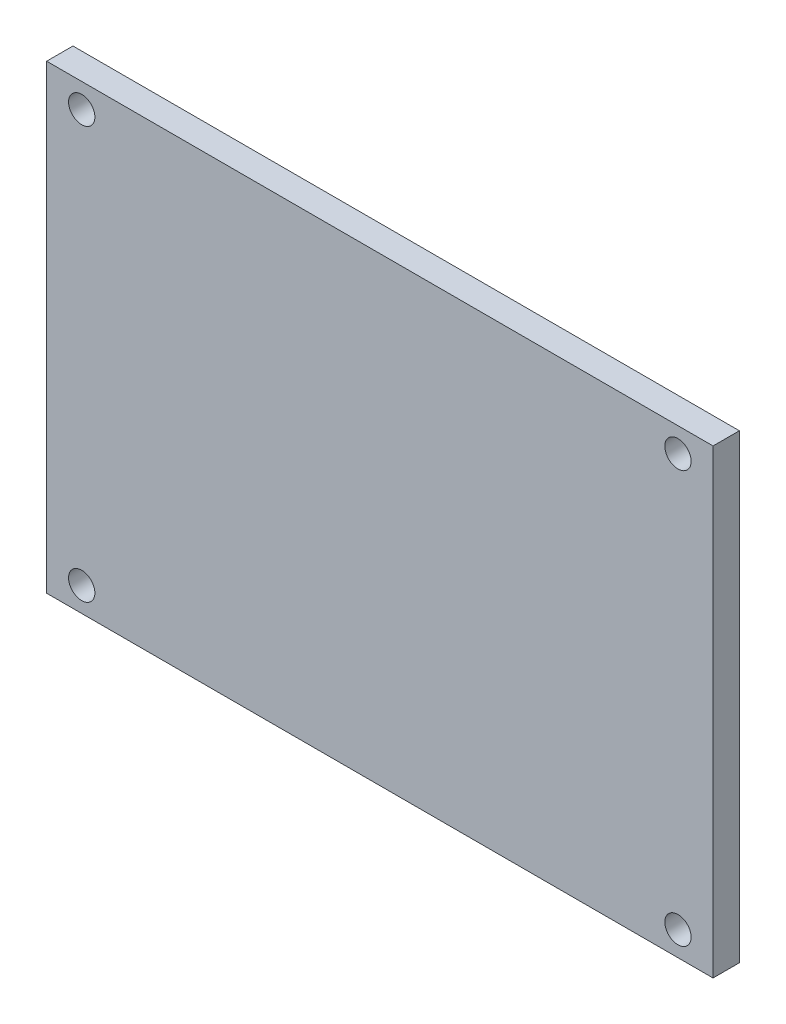
ISO-10303-21;
HEADER;
FILE_DESCRIPTION(('STEP AP214'),'2;1');
FILE_NAME('part.step','',(''),(''),'','','');
FILE_SCHEMA(('AUTOMOTIVE_DESIGN { 1 0 10303 214 1 1 1 1 }'));
ENDSEC;
DATA;
#1=APPLICATION_CONTEXT('core data for automotive mechanical design processes');
#2=APPLICATION_PROTOCOL_DEFINITION('international standard','automotive_design',2000,#1);
#3=PRODUCT_CONTEXT('',#1,'mechanical');
#4=PRODUCT('Part','Part','',(#3));
#5=PRODUCT_RELATED_PRODUCT_CATEGORY('part','',(#4));
#6=PRODUCT_DEFINITION_FORMATION('','',#4);
#7=PRODUCT_DEFINITION_CONTEXT('part definition',#1,'design');
#8=PRODUCT_DEFINITION('design','',#6,#7);
#9=PRODUCT_DEFINITION_SHAPE('','',#8);
#10=(LENGTH_UNIT() NAMED_UNIT(*) SI_UNIT(.MILLI.,.METRE.));
#11=(NAMED_UNIT(*) PLANE_ANGLE_UNIT() SI_UNIT($,.RADIAN.));
#12=(NAMED_UNIT(*) SI_UNIT($,.STERADIAN.) SOLID_ANGLE_UNIT());
#13=UNCERTAINTY_MEASURE_WITH_UNIT(LENGTH_MEASURE(1.E-05),#10,'distance_accuracy_value','');
#14=(GEOMETRIC_REPRESENTATION_CONTEXT(3) GLOBAL_UNCERTAINTY_ASSIGNED_CONTEXT((#13)) GLOBAL_UNIT_ASSIGNED_CONTEXT((#10,
#11,#12)) REPRESENTATION_CONTEXT('',''));
#15=CARTESIAN_POINT('',(0.,0.,0.));
#16=DIRECTION('',(0.,0.,1.));
#17=DIRECTION('',(1.,0.,0.));
#18=AXIS2_PLACEMENT_3D('',#15,#16,#17);
#19=CARTESIAN_POINT('',(0.,0.,3.));
#20=DIRECTION('',(1.,0.,0.));
#21=DIRECTION('',(0.,0.,-1.));
#22=AXIS2_PLACEMENT_3D('',#19,#20,#21);
#23=PLANE('',#22);
#24=DIRECTION('',(0.,-1.,0.));
#25=VECTOR('',#24,1.);
#26=CARTESIAN_POINT('',(0.,0.,0.));
#27=LINE('',#26,#25);
#28=CARTESIAN_POINT('',(0.,52.55,0.));
#29=VERTEX_POINT('',#28);
#30=CARTESIAN_POINT('',(0.,0.,0.));
#31=VERTEX_POINT('',#30);
#32=EDGE_CURVE('E95',#29,#31,#27,.T.);
#33=ORIENTED_EDGE('',*,*,#32,.T.);
#34=DIRECTION('',(0.,0.,-1.));
#35=VECTOR('',#34,1.);
#36=CARTESIAN_POINT('',(0.,0.,3.));
#37=LINE('',#36,#35);
#38=CARTESIAN_POINT('',(0.,0.,3.));
#39=VERTEX_POINT('',#38);
#40=EDGE_CURVE('E11',#39,#31,#37,.T.);
#41=ORIENTED_EDGE('',*,*,#40,.F.);
#42=DIRECTION('',(0.,-1.,0.));
#43=VECTOR('',#42,1.);
#44=CARTESIAN_POINT('',(0.,0.,3.));
#45=LINE('',#44,#43);
#46=CARTESIAN_POINT('',(0.,52.55,3.));
#47=VERTEX_POINT('',#46);
#48=EDGE_CURVE('E83',#47,#39,#45,.T.);
#49=ORIENTED_EDGE('',*,*,#48,.F.);
#50=DIRECTION('',(0.,0.,-1.));
#51=VECTOR('',#50,1.);
#52=CARTESIAN_POINT('',(0.,52.55,3.));
#53=LINE('',#52,#51);
#54=EDGE_CURVE('E91',#47,#29,#53,.T.);
#55=ORIENTED_EDGE('',*,*,#54,.T.);
#56=EDGE_LOOP('',(#33,#41,#49,#55));
#57=FACE_BOUND('',#56,.T.);
#58=ADVANCED_FACE('F32',(#57),#23,.F.);
#59=CARTESIAN_POINT('',(0.,0.,3.));
#60=DIRECTION('',(0.,1.,0.));
#61=DIRECTION('',(0.,0.,1.));
#62=AXIS2_PLACEMENT_3D('',#59,#60,#61);
#63=PLANE('',#62);
#64=DIRECTION('',(1.,0.,0.));
#65=VECTOR('',#64,1.);
#66=CARTESIAN_POINT('',(0.,0.,0.));
#67=LINE('',#66,#65);
#68=CARTESIAN_POINT('',(76.,0.,0.));
#69=VERTEX_POINT('',#68);
#70=EDGE_CURVE('E87',#31,#69,#67,.T.);
#71=ORIENTED_EDGE('',*,*,#70,.T.);
#72=DIRECTION('',(0.,0.,-1.));
#73=VECTOR('',#72,1.);
#74=CARTESIAN_POINT('',(76.,0.,3.));
#75=LINE('',#74,#73);
#76=CARTESIAN_POINT('',(76.,0.,3.));
#77=VERTEX_POINT('',#76);
#78=EDGE_CURVE('E40',#77,#69,#75,.T.);
#79=ORIENTED_EDGE('',*,*,#78,.F.);
#80=DIRECTION('',(1.,0.,0.));
#81=VECTOR('',#80,1.);
#82=CARTESIAN_POINT('',(0.,0.,3.));
#83=LINE('',#82,#81);
#84=EDGE_CURVE('E78',#39,#77,#83,.T.);
#85=ORIENTED_EDGE('',*,*,#84,.F.);
#86=ORIENTED_EDGE('',*,*,#40,.T.);
#87=EDGE_LOOP('',(#71,#79,#85,#86));
#88=FACE_BOUND('',#87,.T.);
#89=ADVANCED_FACE('F86',(#88),#63,.F.);
#90=CARTESIAN_POINT('',(76.,0.,3.));
#91=DIRECTION('',(-1.,0.,0.));
#92=DIRECTION('',(0.,0.,1.));
#93=AXIS2_PLACEMENT_3D('',#90,#91,#92);
#94=PLANE('',#93);
#95=DIRECTION('',(0.,1.,0.));
#96=VECTOR('',#95,1.);
#97=CARTESIAN_POINT('',(76.,0.,0.));
#98=LINE('',#97,#96);
#99=CARTESIAN_POINT('',(76.,52.55,0.));
#100=VERTEX_POINT('',#99);
#101=EDGE_CURVE('E65',#69,#100,#98,.T.);
#102=ORIENTED_EDGE('',*,*,#101,.T.);
#103=DIRECTION('',(0.,0.,-1.));
#104=VECTOR('',#103,1.);
#105=CARTESIAN_POINT('',(76.,52.55,3.));
#106=LINE('',#105,#104);
#107=CARTESIAN_POINT('',(76.,52.55,3.));
#108=VERTEX_POINT('',#107);
#109=EDGE_CURVE('E88',#108,#100,#106,.T.);
#110=ORIENTED_EDGE('',*,*,#109,.F.);
#111=DIRECTION('',(0.,1.,0.));
#112=VECTOR('',#111,1.);
#113=CARTESIAN_POINT('',(76.,0.,3.));
#114=LINE('',#113,#112);
#115=EDGE_CURVE('E81',#77,#108,#114,.T.);
#116=ORIENTED_EDGE('',*,*,#115,.F.);
#117=ORIENTED_EDGE('',*,*,#78,.T.);
#118=EDGE_LOOP('',(#102,#110,#116,#117));
#119=FACE_BOUND('',#118,.T.);
#120=ADVANCED_FACE('F89',(#119),#94,.F.);
#121=CARTESIAN_POINT('',(0.,52.55,3.));
#122=DIRECTION('',(0.,-1.,0.));
#123=DIRECTION('',(0.,0.,-1.));
#124=AXIS2_PLACEMENT_3D('',#121,#122,#123);
#125=PLANE('',#124);
#126=DIRECTION('',(-1.,0.,0.));
#127=VECTOR('',#126,1.);
#128=CARTESIAN_POINT('',(0.,52.55,0.));
#129=LINE('',#128,#127);
#130=EDGE_CURVE('E71',#100,#29,#129,.T.);
#131=ORIENTED_EDGE('',*,*,#130,.T.);
#132=ORIENTED_EDGE('',*,*,#54,.F.);
#133=DIRECTION('',(-1.,0.,0.));
#134=VECTOR('',#133,1.);
#135=CARTESIAN_POINT('',(0.,52.55,3.));
#136=LINE('',#135,#134);
#137=EDGE_CURVE('E48',#108,#47,#136,.T.);
#138=ORIENTED_EDGE('',*,*,#137,.F.);
#139=ORIENTED_EDGE('',*,*,#109,.T.);
#140=EDGE_LOOP('',(#131,#132,#138,#139));
#141=FACE_BOUND('',#140,.T.);
#142=ADVANCED_FACE('F103',(#141),#125,.F.);
#143=CARTESIAN_POINT('',(0.,0.,3.));
#144=DIRECTION('',(0.,0.,-1.));
#145=DIRECTION('',(-1.,0.,0.));
#146=AXIS2_PLACEMENT_3D('',#143,#144,#145);
#147=PLANE('',#146);
#148=CARTESIAN_POINT('',(4.,2.775,3.));
#149=DIRECTION('',(0.,0.,1.));
#150=DIRECTION('',(1.,0.,0.));
#151=AXIS2_PLACEMENT_3D('',#148,#149,#150);
#152=CIRCLE('',#151,1.5);
#153=CARTESIAN_POINT('',(5.49999999999999,2.775,3.));
#154=VERTEX_POINT('',#153);
#155=EDGE_CURVE('E118',#154,#154,#152,.T.);
#156=ORIENTED_EDGE('',*,*,#155,.F.);
#157=EDGE_LOOP('',(#156));
#158=FACE_BOUND('',#157,.T.);
#159=CARTESIAN_POINT('',(72.,2.775,3.));
#160=DIRECTION('',(0.,0.,1.));
#161=DIRECTION('',(1.,0.,0.));
#162=AXIS2_PLACEMENT_3D('',#159,#160,#161);
#163=CIRCLE('',#162,1.5);
#164=CARTESIAN_POINT('',(73.5,2.775,3.));
#165=VERTEX_POINT('',#164);
#166=EDGE_CURVE('E124',#165,#165,#163,.T.);
#167=ORIENTED_EDGE('',*,*,#166,.F.);
#168=EDGE_LOOP('',(#167));
#169=FACE_BOUND('',#168,.T.);
#170=CARTESIAN_POINT('',(72.,49.775,3.));
#171=DIRECTION('',(0.,0.,1.));
#172=DIRECTION('',(1.,0.,0.));
#173=AXIS2_PLACEMENT_3D('',#170,#171,#172);
#174=CIRCLE('',#173,1.5);
#175=CARTESIAN_POINT('',(73.5,49.775,3.));
#176=VERTEX_POINT('',#175);
#177=EDGE_CURVE('E112',#176,#176,#174,.T.);
#178=ORIENTED_EDGE('',*,*,#177,.F.);
#179=EDGE_LOOP('',(#178));
#180=FACE_BOUND('',#179,.T.);
#181=CARTESIAN_POINT('',(3.99999999999999,49.775,3.));
#182=DIRECTION('',(0.,0.,1.));
#183=DIRECTION('',(1.,0.,0.));
#184=AXIS2_PLACEMENT_3D('',#181,#182,#183);
#185=CIRCLE('',#184,1.50000000000001);
#186=CARTESIAN_POINT('',(5.5,49.775,3.));
#187=VERTEX_POINT('',#186);
#188=EDGE_CURVE('E109',#187,#187,#185,.T.);
#189=ORIENTED_EDGE('',*,*,#188,.F.);
#190=EDGE_LOOP('',(#189));
#191=FACE_BOUND('',#190,.T.);
#192=ORIENTED_EDGE('',*,*,#48,.T.);
#193=ORIENTED_EDGE('',*,*,#84,.T.);
#194=ORIENTED_EDGE('',*,*,#115,.T.);
#195=ORIENTED_EDGE('',*,*,#137,.T.);
#196=EDGE_LOOP('',(#192,#193,#194,#195));
#197=FACE_BOUND('',#196,.T.);
#198=ADVANCED_FACE('F79',(#158,#169,#180,#191,#197),#147,.F.);
#199=CARTESIAN_POINT('',(0.,0.,0.));
#200=DIRECTION('',(0.,0.,-1.));
#201=DIRECTION('',(-1.,0.,0.));
#202=AXIS2_PLACEMENT_3D('',#199,#200,#201);
#203=PLANE('',#202);
#204=CARTESIAN_POINT('',(4.,2.775,0.));
#205=DIRECTION('',(0.,0.,1.));
#206=DIRECTION('',(1.,0.,0.));
#207=AXIS2_PLACEMENT_3D('',#204,#205,#206);
#208=CIRCLE('',#207,1.5);
#209=CARTESIAN_POINT('',(5.49999999999999,2.775,0.));
#210=VERTEX_POINT('',#209);
#211=EDGE_CURVE('E115',#210,#210,#208,.T.);
#212=ORIENTED_EDGE('',*,*,#211,.T.);
#213=EDGE_LOOP('',(#212));
#214=FACE_BOUND('',#213,.T.);
#215=CARTESIAN_POINT('',(72.,2.775,0.));
#216=DIRECTION('',(0.,0.,1.));
#217=DIRECTION('',(1.,0.,0.));
#218=AXIS2_PLACEMENT_3D('',#215,#216,#217);
#219=CIRCLE('',#218,1.5);
#220=CARTESIAN_POINT('',(73.5,2.775,0.));
#221=VERTEX_POINT('',#220);
#222=EDGE_CURVE('E121',#221,#221,#219,.T.);
#223=ORIENTED_EDGE('',*,*,#222,.T.);
#224=EDGE_LOOP('',(#223));
#225=FACE_BOUND('',#224,.T.);
#226=CARTESIAN_POINT('',(72.,49.775,0.));
#227=DIRECTION('',(0.,0.,1.));
#228=DIRECTION('',(1.,0.,0.));
#229=AXIS2_PLACEMENT_3D('',#226,#227,#228);
#230=CIRCLE('',#229,1.5);
#231=CARTESIAN_POINT('',(73.5,49.775,0.));
#232=VERTEX_POINT('',#231);
#233=EDGE_CURVE('E127',#232,#232,#230,.T.);
#234=ORIENTED_EDGE('',*,*,#233,.T.);
#235=EDGE_LOOP('',(#234));
#236=FACE_BOUND('',#235,.T.);
#237=CARTESIAN_POINT('',(3.99999999999999,49.775,0.));
#238=DIRECTION('',(0.,0.,1.));
#239=DIRECTION('',(1.,0.,0.));
#240=AXIS2_PLACEMENT_3D('',#237,#238,#239);
#241=CIRCLE('',#240,1.50000000000001);
#242=CARTESIAN_POINT('',(5.5,49.775,0.));
#243=VERTEX_POINT('',#242);
#244=EDGE_CURVE('E98',#243,#243,#241,.T.);
#245=ORIENTED_EDGE('',*,*,#244,.T.);
#246=EDGE_LOOP('',(#245));
#247=FACE_BOUND('',#246,.T.);
#248=ORIENTED_EDGE('',*,*,#32,.F.);
#249=ORIENTED_EDGE('',*,*,#130,.F.);
#250=ORIENTED_EDGE('',*,*,#101,.F.);
#251=ORIENTED_EDGE('',*,*,#70,.F.);
#252=EDGE_LOOP('',(#248,#249,#250,#251));
#253=FACE_BOUND('',#252,.T.);
#254=ADVANCED_FACE('F106',(#214,#225,#236,#247,#253),#203,.T.);
#255=CARTESIAN_POINT('',(3.99999999999999,49.775,0.));
#256=DIRECTION('',(0.,0.,1.));
#257=DIRECTION('',(1.,0.,0.));
#258=AXIS2_PLACEMENT_3D('',#255,#256,#257);
#259=CYLINDRICAL_SURFACE('',#258,1.50000000000001);
#260=ORIENTED_EDGE('',*,*,#244,.F.);
#261=EDGE_LOOP('',(#260));
#262=FACE_BOUND('',#261,.T.);
#263=ORIENTED_EDGE('',*,*,#188,.T.);
#264=EDGE_LOOP('',(#263));
#265=FACE_BOUND('',#264,.T.);
#266=ADVANCED_FACE('F141',(#262,#265),#259,.F.);
#267=CARTESIAN_POINT('',(72.,49.775,0.));
#268=DIRECTION('',(0.,0.,1.));
#269=DIRECTION('',(1.,0.,0.));
#270=AXIS2_PLACEMENT_3D('',#267,#268,#269);
#271=CYLINDRICAL_SURFACE('',#270,1.5);
#272=ORIENTED_EDGE('',*,*,#233,.F.);
#273=EDGE_LOOP('',(#272));
#274=FACE_BOUND('',#273,.T.);
#275=ORIENTED_EDGE('',*,*,#177,.T.);
#276=EDGE_LOOP('',(#275));
#277=FACE_BOUND('',#276,.T.);
#278=ADVANCED_FACE('F133',(#274,#277),#271,.F.);
#279=CARTESIAN_POINT('',(72.,2.775,0.));
#280=DIRECTION('',(0.,0.,1.));
#281=DIRECTION('',(1.,0.,0.));
#282=AXIS2_PLACEMENT_3D('',#279,#280,#281);
#283=CYLINDRICAL_SURFACE('',#282,1.5);
#284=ORIENTED_EDGE('',*,*,#222,.F.);
#285=EDGE_LOOP('',(#284));
#286=FACE_BOUND('',#285,.T.);
#287=ORIENTED_EDGE('',*,*,#166,.T.);
#288=EDGE_LOOP('',(#287));
#289=FACE_BOUND('',#288,.T.);
#290=ADVANCED_FACE('F149',(#286,#289),#283,.F.);
#291=CARTESIAN_POINT('',(4.,2.775,0.));
#292=DIRECTION('',(0.,0.,1.));
#293=DIRECTION('',(1.,0.,0.));
#294=AXIS2_PLACEMENT_3D('',#291,#292,#293);
#295=CYLINDRICAL_SURFACE('',#294,1.5);
#296=ORIENTED_EDGE('',*,*,#211,.F.);
#297=EDGE_LOOP('',(#296));
#298=FACE_BOUND('',#297,.T.);
#299=ORIENTED_EDGE('',*,*,#155,.T.);
#300=EDGE_LOOP('',(#299));
#301=FACE_BOUND('',#300,.T.);
#302=ADVANCED_FACE('F197',(#298,#301),#295,.F.);
#303=CLOSED_SHELL('',(#58,#89,#120,#142,#198,#254,#266,#278,#290,#302));
#304=MANIFOLD_SOLID_BREP('B2',#303);
#305=ADVANCED_BREP_SHAPE_REPRESENTATION('',(#18,#304),#14);
#306=SHAPE_DEFINITION_REPRESENTATION(#9,#305);
ENDSEC;
END-ISO-10303-21;
